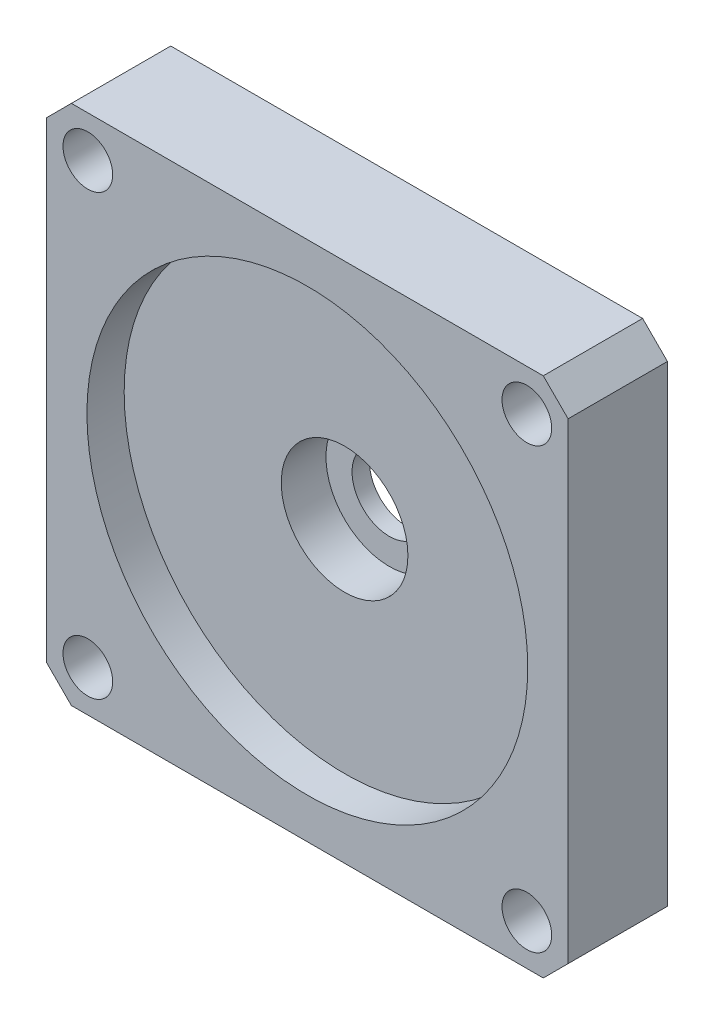
ISO-10303-21;
HEADER;
FILE_DESCRIPTION(('STEP AP214'),'2;1');
FILE_NAME('part.step','',(''),(''),'','','');
FILE_SCHEMA(('AUTOMOTIVE_DESIGN { 1 0 10303 214 1 1 1 1 }'));
ENDSEC;
DATA;
#1=APPLICATION_CONTEXT('core data for automotive mechanical design processes');
#2=APPLICATION_PROTOCOL_DEFINITION('international standard','automotive_design',2000,#1);
#3=PRODUCT_CONTEXT('',#1,'mechanical');
#4=PRODUCT('Part','Part','',(#3));
#5=PRODUCT_RELATED_PRODUCT_CATEGORY('part','',(#4));
#6=PRODUCT_DEFINITION_FORMATION('','',#4);
#7=PRODUCT_DEFINITION_CONTEXT('part definition',#1,'design');
#8=PRODUCT_DEFINITION('design','',#6,#7);
#9=PRODUCT_DEFINITION_SHAPE('','',#8);
#10=(LENGTH_UNIT() NAMED_UNIT(*) SI_UNIT(.MILLI.,.METRE.));
#11=(NAMED_UNIT(*) PLANE_ANGLE_UNIT() SI_UNIT($,.RADIAN.));
#12=(NAMED_UNIT(*) SI_UNIT($,.STERADIAN.) SOLID_ANGLE_UNIT());
#13=UNCERTAINTY_MEASURE_WITH_UNIT(LENGTH_MEASURE(1.E-05),#10,'distance_accuracy_value','');
#14=(GEOMETRIC_REPRESENTATION_CONTEXT(3) GLOBAL_UNCERTAINTY_ASSIGNED_CONTEXT((#13)) GLOBAL_UNIT_ASSIGNED_CONTEXT((#10,
#11,#12)) REPRESENTATION_CONTEXT('',''));
#15=CARTESIAN_POINT('',(0.,0.,0.));
#16=DIRECTION('',(0.,0.,1.));
#17=DIRECTION('',(1.,0.,0.));
#18=AXIS2_PLACEMENT_3D('',#15,#16,#17);
#19=CARTESIAN_POINT('',(21.,21.,8.));
#20=DIRECTION('',(-1.,0.,0.));
#21=DIRECTION('',(0.,0.,1.));
#22=AXIS2_PLACEMENT_3D('',#19,#20,#21);
#23=PLANE('',#22);
#24=DIRECTION('',(0.,1.,0.));
#25=VECTOR('',#24,1.);
#26=CARTESIAN_POINT('',(21.,21.,8.));
#27=LINE('',#26,#25);
#28=CARTESIAN_POINT('',(21.,-19.,8.));
#29=VERTEX_POINT('',#28);
#30=CARTESIAN_POINT('',(21.,19.,8.));
#31=VERTEX_POINT('',#30);
#32=EDGE_CURVE('E127',#29,#31,#27,.T.);
#33=ORIENTED_EDGE('',*,*,#32,.F.);
#34=DIRECTION('',(0.,0.,-1.));
#35=VECTOR('',#34,1.);
#36=CARTESIAN_POINT('',(21.,-19.,8.));
#37=LINE('',#36,#35);
#38=CARTESIAN_POINT('',(21.,-19.,0.));
#39=VERTEX_POINT('',#38);
#40=EDGE_CURVE('E112',#29,#39,#37,.T.);
#41=ORIENTED_EDGE('',*,*,#40,.T.);
#42=DIRECTION('',(0.,1.,0.));
#43=VECTOR('',#42,1.);
#44=CARTESIAN_POINT('',(21.,21.,0.));
#45=LINE('',#44,#43);
#46=CARTESIAN_POINT('',(21.,19.,0.));
#47=VERTEX_POINT('',#46);
#48=EDGE_CURVE('E124',#39,#47,#45,.T.);
#49=ORIENTED_EDGE('',*,*,#48,.T.);
#50=DIRECTION('',(0.,0.,1.));
#51=VECTOR('',#50,1.);
#52=CARTESIAN_POINT('',(21.,19.,8.));
#53=LINE('',#52,#51);
#54=EDGE_CURVE('E129',#47,#31,#53,.T.);
#55=ORIENTED_EDGE('',*,*,#54,.T.);
#56=EDGE_LOOP('',(#33,#41,#49,#55));
#57=FACE_BOUND('',#56,.T.);
#58=ADVANCED_FACE('F41',(#57),#23,.F.);
#59=CARTESIAN_POINT('',(-21.,21.,8.));
#60=DIRECTION('',(0.,-1.,0.));
#61=DIRECTION('',(0.,0.,-1.));
#62=AXIS2_PLACEMENT_3D('',#59,#60,#61);
#63=PLANE('',#62);
#64=DIRECTION('',(-1.,0.,0.));
#65=VECTOR('',#64,1.);
#66=CARTESIAN_POINT('',(-21.,21.,0.));
#67=LINE('',#66,#65);
#68=CARTESIAN_POINT('',(19.,21.,0.));
#69=VERTEX_POINT('',#68);
#70=CARTESIAN_POINT('',(-19.,21.,0.));
#71=VERTEX_POINT('',#70);
#72=EDGE_CURVE('E133',#69,#71,#67,.T.);
#73=ORIENTED_EDGE('',*,*,#72,.T.);
#74=DIRECTION('',(0.,0.,1.));
#75=VECTOR('',#74,1.);
#76=CARTESIAN_POINT('',(-19.,21.,8.));
#77=LINE('',#76,#75);
#78=CARTESIAN_POINT('',(-19.,21.,8.));
#79=VERTEX_POINT('',#78);
#80=EDGE_CURVE('E11',#71,#79,#77,.T.);
#81=ORIENTED_EDGE('',*,*,#80,.T.);
#82=DIRECTION('',(-1.,0.,0.));
#83=VECTOR('',#82,1.);
#84=CARTESIAN_POINT('',(-21.,21.,8.));
#85=LINE('',#84,#83);
#86=CARTESIAN_POINT('',(19.,21.,8.));
#87=VERTEX_POINT('',#86);
#88=EDGE_CURVE('E173',#87,#79,#85,.T.);
#89=ORIENTED_EDGE('',*,*,#88,.F.);
#90=DIRECTION('',(0.,0.,-1.));
#91=VECTOR('',#90,1.);
#92=CARTESIAN_POINT('',(19.,21.,8.));
#93=LINE('',#92,#91);
#94=EDGE_CURVE('E50',#87,#69,#93,.T.);
#95=ORIENTED_EDGE('',*,*,#94,.T.);
#96=EDGE_LOOP('',(#73,#81,#89,#95));
#97=FACE_BOUND('',#96,.T.);
#98=ADVANCED_FACE('F171',(#97),#63,.F.);
#99=CARTESIAN_POINT('',(-21.,21.,8.));
#100=DIRECTION('',(1.,0.,0.));
#101=DIRECTION('',(0.,0.,-1.));
#102=AXIS2_PLACEMENT_3D('',#99,#100,#101);
#103=PLANE('',#102);
#104=DIRECTION('',(0.,-1.,0.));
#105=VECTOR('',#104,1.);
#106=CARTESIAN_POINT('',(-21.,21.,0.));
#107=LINE('',#106,#105);
#108=CARTESIAN_POINT('',(-21.,19.,0.));
#109=VERTEX_POINT('',#108);
#110=CARTESIAN_POINT('',(-21.,-19.,0.));
#111=VERTEX_POINT('',#110);
#112=EDGE_CURVE('E137',#109,#111,#107,.T.);
#113=ORIENTED_EDGE('',*,*,#112,.T.);
#114=DIRECTION('',(0.,0.,1.));
#115=VECTOR('',#114,1.);
#116=CARTESIAN_POINT('',(-21.,-19.,8.));
#117=LINE('',#116,#115);
#118=CARTESIAN_POINT('',(-21.,-19.,8.));
#119=VERTEX_POINT('',#118);
#120=EDGE_CURVE('E57',#111,#119,#117,.T.);
#121=ORIENTED_EDGE('',*,*,#120,.T.);
#122=DIRECTION('',(0.,-1.,0.));
#123=VECTOR('',#122,1.);
#124=CARTESIAN_POINT('',(-21.,21.,8.));
#125=LINE('',#124,#123);
#126=CARTESIAN_POINT('',(-21.,19.,8.));
#127=VERTEX_POINT('',#126);
#128=EDGE_CURVE('E181',#127,#119,#125,.T.);
#129=ORIENTED_EDGE('',*,*,#128,.F.);
#130=DIRECTION('',(0.,0.,-1.));
#131=VECTOR('',#130,1.);
#132=CARTESIAN_POINT('',(-21.,19.,8.));
#133=LINE('',#132,#131);
#134=EDGE_CURVE('E164',#127,#109,#133,.T.);
#135=ORIENTED_EDGE('',*,*,#134,.T.);
#136=EDGE_LOOP('',(#113,#121,#129,#135));
#137=FACE_BOUND('',#136,.T.);
#138=ADVANCED_FACE('F180',(#137),#103,.F.);
#139=CARTESIAN_POINT('',(-21.,-21.,8.));
#140=DIRECTION('',(0.,1.,0.));
#141=DIRECTION('',(0.,0.,1.));
#142=AXIS2_PLACEMENT_3D('',#139,#140,#141);
#143=PLANE('',#142);
#144=DIRECTION('',(1.,0.,0.));
#145=VECTOR('',#144,1.);
#146=CARTESIAN_POINT('',(-21.,-21.,0.));
#147=LINE('',#146,#145);
#148=CARTESIAN_POINT('',(-19.,-21.,0.));
#149=VERTEX_POINT('',#148);
#150=CARTESIAN_POINT('',(19.,-21.,0.));
#151=VERTEX_POINT('',#150);
#152=EDGE_CURVE('E147',#149,#151,#147,.T.);
#153=ORIENTED_EDGE('',*,*,#152,.T.);
#154=DIRECTION('',(0.,0.,1.));
#155=VECTOR('',#154,1.);
#156=CARTESIAN_POINT('',(19.,-21.,8.));
#157=LINE('',#156,#155);
#158=CARTESIAN_POINT('',(19.,-21.,8.));
#159=VERTEX_POINT('',#158);
#160=EDGE_CURVE('E113',#151,#159,#157,.T.);
#161=ORIENTED_EDGE('',*,*,#160,.T.);
#162=DIRECTION('',(1.,0.,0.));
#163=VECTOR('',#162,1.);
#164=CARTESIAN_POINT('',(-21.,-21.,8.));
#165=LINE('',#164,#163);
#166=CARTESIAN_POINT('',(-19.,-21.,8.));
#167=VERTEX_POINT('',#166);
#168=EDGE_CURVE('E143',#167,#159,#165,.T.);
#169=ORIENTED_EDGE('',*,*,#168,.F.);
#170=DIRECTION('',(0.,0.,-1.));
#171=VECTOR('',#170,1.);
#172=CARTESIAN_POINT('',(-19.,-21.,8.));
#173=LINE('',#172,#171);
#174=EDGE_CURVE('E118',#167,#149,#173,.T.);
#175=ORIENTED_EDGE('',*,*,#174,.T.);
#176=EDGE_LOOP('',(#153,#161,#169,#175));
#177=FACE_BOUND('',#176,.T.);
#178=ADVANCED_FACE('F257',(#177),#143,.F.);
#179=CARTESIAN_POINT('',(0.,0.,8.));
#180=DIRECTION('',(0.,0.,1.));
#181=DIRECTION('',(1.,0.,0.));
#182=AXIS2_PLACEMENT_3D('',#179,#180,#181);
#183=PLANE('',#182);
#184=CARTESIAN_POINT('',(0.,0.,8.));
#185=DIRECTION('',(0.,0.,1.));
#186=DIRECTION('',(1.,0.,0.));
#187=AXIS2_PLACEMENT_3D('',#184,#185,#186);
#188=CIRCLE('',#187,17.75);
#189=CARTESIAN_POINT('',(17.75,0.,8.));
#190=VERTEX_POINT('',#189);
#191=EDGE_CURVE('E208',#190,#190,#188,.T.);
#192=ORIENTED_EDGE('',*,*,#191,.F.);
#193=EDGE_LOOP('',(#192));
#194=FACE_BOUND('',#193,.T.);
#195=CARTESIAN_POINT('',(-17.6776695296637,-17.6776695296637,8.));
#196=DIRECTION('',(0.,0.,1.));
#197=DIRECTION('',(1.,0.,0.));
#198=AXIS2_PLACEMENT_3D('',#195,#196,#197);
#199=CIRCLE('',#198,2.);
#200=CARTESIAN_POINT('',(-15.6776695296637,-17.6776695296637,8.));
#201=VERTEX_POINT('',#200);
#202=EDGE_CURVE('E190',#201,#201,#199,.T.);
#203=ORIENTED_EDGE('',*,*,#202,.F.);
#204=EDGE_LOOP('',(#203));
#205=FACE_BOUND('',#204,.T.);
#206=CARTESIAN_POINT('',(17.6776695296637,-17.6776695296637,8.));
#207=DIRECTION('',(0.,0.,1.));
#208=DIRECTION('',(1.,0.,0.));
#209=AXIS2_PLACEMENT_3D('',#206,#207,#208);
#210=CIRCLE('',#209,2.);
#211=CARTESIAN_POINT('',(19.6776695296637,-17.6776695296637,8.));
#212=VERTEX_POINT('',#211);
#213=EDGE_CURVE('E198',#212,#212,#210,.T.);
#214=ORIENTED_EDGE('',*,*,#213,.F.);
#215=EDGE_LOOP('',(#214));
#216=FACE_BOUND('',#215,.T.);
#217=CARTESIAN_POINT('',(17.6776695296637,17.6776695296637,8.));
#218=DIRECTION('',(0.,0.,1.));
#219=DIRECTION('',(1.,0.,0.));
#220=AXIS2_PLACEMENT_3D('',#217,#218,#219);
#221=CIRCLE('',#220,2.);
#222=CARTESIAN_POINT('',(19.6776695296637,17.6776695296637,8.));
#223=VERTEX_POINT('',#222);
#224=EDGE_CURVE('E189',#223,#223,#221,.T.);
#225=ORIENTED_EDGE('',*,*,#224,.F.);
#226=EDGE_LOOP('',(#225));
#227=FACE_BOUND('',#226,.T.);
#228=CARTESIAN_POINT('',(-17.6776695296637,17.6776695296637,8.));
#229=DIRECTION('',(0.,0.,1.));
#230=DIRECTION('',(1.,0.,0.));
#231=AXIS2_PLACEMENT_3D('',#228,#229,#230);
#232=CIRCLE('',#231,2.);
#233=CARTESIAN_POINT('',(-15.6776695296637,17.6776695296637,8.));
#234=VERTEX_POINT('',#233);
#235=EDGE_CURVE('E140',#234,#234,#232,.T.);
#236=ORIENTED_EDGE('',*,*,#235,.F.);
#237=EDGE_LOOP('',(#236));
#238=FACE_BOUND('',#237,.T.);
#239=ORIENTED_EDGE('',*,*,#168,.T.);
#240=DIRECTION('',(-0.707106781186549,-0.707106781186546,0.));
#241=VECTOR('',#240,1.);
#242=CARTESIAN_POINT('',(20.,-20.,8.));
#243=LINE('',#242,#241);
#244=EDGE_CURVE('E162',#159,#29,#243,.F.);
#245=ORIENTED_EDGE('',*,*,#244,.T.);
#246=ORIENTED_EDGE('',*,*,#32,.T.);
#247=DIRECTION('',(0.707106781186546,-0.707106781186549,0.));
#248=VECTOR('',#247,1.);
#249=CARTESIAN_POINT('',(20.,20.,8.));
#250=LINE('',#249,#248);
#251=EDGE_CURVE('E157',#31,#87,#250,.F.);
#252=ORIENTED_EDGE('',*,*,#251,.T.);
#253=ORIENTED_EDGE('',*,*,#88,.T.);
#254=DIRECTION('',(0.707106781186549,0.707106781186546,0.));
#255=VECTOR('',#254,1.);
#256=CARTESIAN_POINT('',(-20.,20.,8.));
#257=LINE('',#256,#255);
#258=EDGE_CURVE('E64',#79,#127,#257,.F.);
#259=ORIENTED_EDGE('',*,*,#258,.T.);
#260=ORIENTED_EDGE('',*,*,#128,.T.);
#261=DIRECTION('',(-0.707106781186546,0.707106781186549,0.));
#262=VECTOR('',#261,1.);
#263=CARTESIAN_POINT('',(-20.,-20.,8.));
#264=LINE('',#263,#262);
#265=EDGE_CURVE('E160',#119,#167,#264,.F.);
#266=ORIENTED_EDGE('',*,*,#265,.T.);
#267=EDGE_LOOP('',(#239,#245,#246,#252,#253,#259,#260,#266));
#268=FACE_BOUND('',#267,.T.);
#269=ADVANCED_FACE('F254',(#194,#205,#216,#227,#238,#268),#183,.T.);
#270=CARTESIAN_POINT('',(0.,0.,0.));
#271=DIRECTION('',(0.,0.,1.));
#272=DIRECTION('',(1.,0.,0.));
#273=AXIS2_PLACEMENT_3D('',#270,#271,#272);
#274=PLANE('',#273);
#275=CARTESIAN_POINT('',(0.,0.,0.));
#276=DIRECTION('',(0.,0.,1.));
#277=DIRECTION('',(1.,0.,0.));
#278=AXIS2_PLACEMENT_3D('',#275,#276,#277);
#279=CIRCLE('',#278,3.);
#280=CARTESIAN_POINT('',(3.,0.,0.));
#281=VERTEX_POINT('',#280);
#282=EDGE_CURVE('E217',#281,#281,#279,.F.);
#283=ORIENTED_EDGE('',*,*,#282,.F.);
#284=EDGE_LOOP('',(#283));
#285=FACE_BOUND('',#284,.T.);
#286=CARTESIAN_POINT('',(-17.6776695296637,-17.6776695296637,0.));
#287=DIRECTION('',(0.,0.,1.));
#288=DIRECTION('',(1.,0.,0.));
#289=AXIS2_PLACEMENT_3D('',#286,#287,#288);
#290=CIRCLE('',#289,2.);
#291=CARTESIAN_POINT('',(-15.6776695296637,-17.6776695296637,0.));
#292=VERTEX_POINT('',#291);
#293=EDGE_CURVE('E194',#292,#292,#290,.F.);
#294=ORIENTED_EDGE('',*,*,#293,.F.);
#295=EDGE_LOOP('',(#294));
#296=FACE_BOUND('',#295,.T.);
#297=CARTESIAN_POINT('',(17.6776695296637,-17.6776695296637,0.));
#298=DIRECTION('',(0.,0.,1.));
#299=DIRECTION('',(1.,0.,0.));
#300=AXIS2_PLACEMENT_3D('',#297,#298,#299);
#301=CIRCLE('',#300,2.);
#302=CARTESIAN_POINT('',(19.6776695296637,-17.6776695296637,0.));
#303=VERTEX_POINT('',#302);
#304=EDGE_CURVE('E193',#303,#303,#301,.F.);
#305=ORIENTED_EDGE('',*,*,#304,.F.);
#306=EDGE_LOOP('',(#305));
#307=FACE_BOUND('',#306,.T.);
#308=CARTESIAN_POINT('',(17.6776695296637,17.6776695296637,0.));
#309=DIRECTION('',(0.,0.,1.));
#310=DIRECTION('',(1.,0.,0.));
#311=AXIS2_PLACEMENT_3D('',#308,#309,#310);
#312=CIRCLE('',#311,2.);
#313=CARTESIAN_POINT('',(19.6776695296637,17.6776695296637,0.));
#314=VERTEX_POINT('',#313);
#315=EDGE_CURVE('E201',#314,#314,#312,.F.);
#316=ORIENTED_EDGE('',*,*,#315,.F.);
#317=EDGE_LOOP('',(#316));
#318=FACE_BOUND('',#317,.T.);
#319=CARTESIAN_POINT('',(-17.6776695296637,17.6776695296637,0.));
#320=DIRECTION('',(0.,0.,1.));
#321=DIRECTION('',(1.,0.,0.));
#322=AXIS2_PLACEMENT_3D('',#319,#320,#321);
#323=CIRCLE('',#322,2.);
#324=CARTESIAN_POINT('',(-15.6776695296637,17.6776695296637,0.));
#325=VERTEX_POINT('',#324);
#326=EDGE_CURVE('E134',#325,#325,#323,.F.);
#327=ORIENTED_EDGE('',*,*,#326,.F.);
#328=EDGE_LOOP('',(#327));
#329=FACE_BOUND('',#328,.T.);
#330=ORIENTED_EDGE('',*,*,#48,.F.);
#331=DIRECTION('',(0.707106781186549,0.707106781186546,0.));
#332=VECTOR('',#331,1.);
#333=CARTESIAN_POINT('',(21.,-19.,0.));
#334=LINE('',#333,#332);
#335=EDGE_CURVE('E108',#39,#151,#334,.F.);
#336=ORIENTED_EDGE('',*,*,#335,.T.);
#337=ORIENTED_EDGE('',*,*,#152,.F.);
#338=DIRECTION('',(0.707106781186546,-0.707106781186549,0.));
#339=VECTOR('',#338,1.);
#340=CARTESIAN_POINT('',(-19.,-21.,0.));
#341=LINE('',#340,#339);
#342=EDGE_CURVE('E119',#149,#111,#341,.F.);
#343=ORIENTED_EDGE('',*,*,#342,.T.);
#344=ORIENTED_EDGE('',*,*,#112,.F.);
#345=DIRECTION('',(-0.707106781186549,-0.707106781186546,0.));
#346=VECTOR('',#345,1.);
#347=CARTESIAN_POINT('',(-21.,19.,0.));
#348=LINE('',#347,#346);
#349=EDGE_CURVE('E151',#109,#71,#348,.F.);
#350=ORIENTED_EDGE('',*,*,#349,.T.);
#351=ORIENTED_EDGE('',*,*,#72,.F.);
#352=DIRECTION('',(-0.707106781186546,0.707106781186549,0.));
#353=VECTOR('',#352,1.);
#354=CARTESIAN_POINT('',(19.,21.,0.));
#355=LINE('',#354,#353);
#356=EDGE_CURVE('E128',#69,#47,#355,.F.);
#357=ORIENTED_EDGE('',*,*,#356,.T.);
#358=EDGE_LOOP('',(#330,#336,#337,#343,#344,#350,#351,#357));
#359=FACE_BOUND('',#358,.T.);
#360=ADVANCED_FACE('F131',(#285,#296,#307,#318,#329,#359),#274,.F.);
#361=CARTESIAN_POINT('',(-17.6776695296637,17.6776695296637,-0.000999999999999265));
#362=DIRECTION('',(0.,0.,1.));
#363=DIRECTION('',(1.,0.,0.));
#364=AXIS2_PLACEMENT_3D('',#361,#362,#363);
#365=CYLINDRICAL_SURFACE('',#364,2.);
#366=ORIENTED_EDGE('',*,*,#235,.T.);
#367=EDGE_LOOP('',(#366));
#368=FACE_BOUND('',#367,.T.);
#369=ORIENTED_EDGE('',*,*,#326,.T.);
#370=EDGE_LOOP('',(#369));
#371=FACE_BOUND('',#370,.T.);
#372=ADVANCED_FACE('F301',(#368,#371),#365,.F.);
#373=CARTESIAN_POINT('',(17.6776695296637,17.6776695296637,-0.000999999999999265));
#374=DIRECTION('',(0.,0.,1.));
#375=DIRECTION('',(1.,0.,0.));
#376=AXIS2_PLACEMENT_3D('',#373,#374,#375);
#377=CYLINDRICAL_SURFACE('',#376,2.);
#378=ORIENTED_EDGE('',*,*,#224,.T.);
#379=EDGE_LOOP('',(#378));
#380=FACE_BOUND('',#379,.T.);
#381=ORIENTED_EDGE('',*,*,#315,.T.);
#382=EDGE_LOOP('',(#381));
#383=FACE_BOUND('',#382,.T.);
#384=ADVANCED_FACE('F306',(#380,#383),#377,.F.);
#385=CARTESIAN_POINT('',(17.6776695296637,-17.6776695296637,-0.000999999999999265));
#386=DIRECTION('',(0.,0.,1.));
#387=DIRECTION('',(1.,0.,0.));
#388=AXIS2_PLACEMENT_3D('',#385,#386,#387);
#389=CYLINDRICAL_SURFACE('',#388,2.);
#390=ORIENTED_EDGE('',*,*,#213,.T.);
#391=EDGE_LOOP('',(#390));
#392=FACE_BOUND('',#391,.T.);
#393=ORIENTED_EDGE('',*,*,#304,.T.);
#394=EDGE_LOOP('',(#393));
#395=FACE_BOUND('',#394,.T.);
#396=ADVANCED_FACE('F310',(#392,#395),#389,.F.);
#397=CARTESIAN_POINT('',(-17.6776695296637,-17.6776695296637,-0.000999999999999265));
#398=DIRECTION('',(0.,0.,1.));
#399=DIRECTION('',(1.,0.,0.));
#400=AXIS2_PLACEMENT_3D('',#397,#398,#399);
#401=CYLINDRICAL_SURFACE('',#400,2.);
#402=ORIENTED_EDGE('',*,*,#202,.T.);
#403=EDGE_LOOP('',(#402));
#404=FACE_BOUND('',#403,.T.);
#405=ORIENTED_EDGE('',*,*,#293,.T.);
#406=EDGE_LOOP('',(#405));
#407=FACE_BOUND('',#406,.T.);
#408=ADVANCED_FACE('F250',(#404,#407),#401,.F.);
#409=CARTESIAN_POINT('',(0.,0.,5.));
#410=DIRECTION('',(0.,0.,1.));
#411=DIRECTION('',(1.,0.,0.));
#412=AXIS2_PLACEMENT_3D('',#409,#410,#411);
#413=CYLINDRICAL_SURFACE('',#412,17.75);
#414=CARTESIAN_POINT('',(0.,0.,5.));
#415=DIRECTION('',(0.,0.,1.));
#416=DIRECTION('',(1.,0.,0.));
#417=AXIS2_PLACEMENT_3D('',#414,#415,#416);
#418=CIRCLE('',#417,17.75);
#419=CARTESIAN_POINT('',(17.75,0.,5.));
#420=VERTEX_POINT('',#419);
#421=EDGE_CURVE('E197',#420,#420,#418,.T.);
#422=ORIENTED_EDGE('',*,*,#421,.F.);
#423=EDGE_LOOP('',(#422));
#424=FACE_BOUND('',#423,.T.);
#425=ORIENTED_EDGE('',*,*,#191,.T.);
#426=EDGE_LOOP('',(#425));
#427=FACE_BOUND('',#426,.T.);
#428=ADVANCED_FACE('F244',(#424,#427),#413,.F.);
#429=CARTESIAN_POINT('',(0.,0.,5.));
#430=DIRECTION('',(0.,0.,1.));
#431=DIRECTION('',(1.,0.,0.));
#432=AXIS2_PLACEMENT_3D('',#429,#430,#431);
#433=PLANE('',#432);
#434=CARTESIAN_POINT('',(0.,0.,5.));
#435=DIRECTION('',(0.,0.,1.));
#436=DIRECTION('',(1.,0.,0.));
#437=AXIS2_PLACEMENT_3D('',#434,#435,#436);
#438=CIRCLE('',#437,5.1);
#439=CARTESIAN_POINT('',(5.1,0.,5.));
#440=VERTEX_POINT('',#439);
#441=EDGE_CURVE('E214',#440,#440,#438,.T.);
#442=ORIENTED_EDGE('',*,*,#441,.F.);
#443=EDGE_LOOP('',(#442));
#444=FACE_BOUND('',#443,.T.);
#445=ORIENTED_EDGE('',*,*,#421,.T.);
#446=EDGE_LOOP('',(#445));
#447=FACE_BOUND('',#446,.T.);
#448=ADVANCED_FACE('F238',(#444,#447),#433,.T.);
#449=CARTESIAN_POINT('',(0.,0.,1.4));
#450=DIRECTION('',(0.,0.,1.));
#451=DIRECTION('',(1.,0.,0.));
#452=AXIS2_PLACEMENT_3D('',#449,#450,#451);
#453=CYLINDRICAL_SURFACE('',#452,5.1);
#454=CARTESIAN_POINT('',(0.,0.,1.4));
#455=DIRECTION('',(0.,0.,1.));
#456=DIRECTION('',(1.,0.,0.));
#457=AXIS2_PLACEMENT_3D('',#454,#455,#456);
#458=CIRCLE('',#457,5.1);
#459=CARTESIAN_POINT('',(5.1,0.,1.4));
#460=VERTEX_POINT('',#459);
#461=EDGE_CURVE('E211',#460,#460,#458,.T.);
#462=ORIENTED_EDGE('',*,*,#461,.F.);
#463=EDGE_LOOP('',(#462));
#464=FACE_BOUND('',#463,.T.);
#465=ORIENTED_EDGE('',*,*,#441,.T.);
#466=EDGE_LOOP('',(#465));
#467=FACE_BOUND('',#466,.T.);
#468=ADVANCED_FACE('F232',(#464,#467),#453,.F.);
#469=CARTESIAN_POINT('',(0.,0.,1.4));
#470=DIRECTION('',(0.,0.,1.));
#471=DIRECTION('',(1.,0.,0.));
#472=AXIS2_PLACEMENT_3D('',#469,#470,#471);
#473=PLANE('',#472);
#474=CARTESIAN_POINT('',(0.,0.,1.4));
#475=DIRECTION('',(0.,0.,1.));
#476=DIRECTION('',(1.,0.,0.));
#477=AXIS2_PLACEMENT_3D('',#474,#475,#476);
#478=CIRCLE('',#477,3.);
#479=CARTESIAN_POINT('',(3.,0.,1.4));
#480=VERTEX_POINT('',#479);
#481=EDGE_CURVE('E222',#480,#480,#478,.T.);
#482=ORIENTED_EDGE('',*,*,#481,.F.);
#483=EDGE_LOOP('',(#482));
#484=FACE_BOUND('',#483,.T.);
#485=ORIENTED_EDGE('',*,*,#461,.T.);
#486=EDGE_LOOP('',(#485));
#487=FACE_BOUND('',#486,.T.);
#488=ADVANCED_FACE('F229',(#484,#487),#473,.T.);
#489=CARTESIAN_POINT('',(0.,0.,-0.000999999999999916));
#490=DIRECTION('',(0.,0.,1.));
#491=DIRECTION('',(1.,0.,0.));
#492=AXIS2_PLACEMENT_3D('',#489,#490,#491);
#493=CYLINDRICAL_SURFACE('',#492,3.);
#494=ORIENTED_EDGE('',*,*,#481,.T.);
#495=EDGE_LOOP('',(#494));
#496=FACE_BOUND('',#495,.T.);
#497=ORIENTED_EDGE('',*,*,#282,.T.);
#498=EDGE_LOOP('',(#497));
#499=FACE_BOUND('',#498,.T.);
#500=ADVANCED_FACE('F226',(#496,#499),#493,.F.);
#501=CARTESIAN_POINT('',(21.,-19.,8.));
#502=DIRECTION('',(-0.707106781186546,0.707106781186549,0.));
#503=DIRECTION('',(0.,0.,-1.));
#504=AXIS2_PLACEMENT_3D('',#501,#502,#503);
#505=PLANE('',#504);
#506=ORIENTED_EDGE('',*,*,#244,.F.);
#507=ORIENTED_EDGE('',*,*,#160,.F.);
#508=ORIENTED_EDGE('',*,*,#335,.F.);
#509=ORIENTED_EDGE('',*,*,#40,.F.);
#510=EDGE_LOOP('',(#506,#507,#508,#509));
#511=FACE_BOUND('',#510,.T.);
#512=ADVANCED_FACE('F111',(#511),#505,.F.);
#513=CARTESIAN_POINT('',(-19.,-21.,8.));
#514=DIRECTION('',(0.707106781186549,0.707106781186546,0.));
#515=DIRECTION('',(0.,0.,-1.));
#516=AXIS2_PLACEMENT_3D('',#513,#514,#515);
#517=PLANE('',#516);
#518=ORIENTED_EDGE('',*,*,#265,.F.);
#519=ORIENTED_EDGE('',*,*,#120,.F.);
#520=ORIENTED_EDGE('',*,*,#342,.F.);
#521=ORIENTED_EDGE('',*,*,#174,.F.);
#522=EDGE_LOOP('',(#518,#519,#520,#521));
#523=FACE_BOUND('',#522,.T.);
#524=ADVANCED_FACE('F270',(#523),#517,.F.);
#525=CARTESIAN_POINT('',(-21.,19.,8.));
#526=DIRECTION('',(0.707106781186546,-0.707106781186549,0.));
#527=DIRECTION('',(0.,0.,-1.));
#528=AXIS2_PLACEMENT_3D('',#525,#526,#527);
#529=PLANE('',#528);
#530=ORIENTED_EDGE('',*,*,#258,.F.);
#531=ORIENTED_EDGE('',*,*,#80,.F.);
#532=ORIENTED_EDGE('',*,*,#349,.F.);
#533=ORIENTED_EDGE('',*,*,#134,.F.);
#534=EDGE_LOOP('',(#530,#531,#532,#533));
#535=FACE_BOUND('',#534,.T.);
#536=ADVANCED_FACE('F179',(#535),#529,.F.);
#537=CARTESIAN_POINT('',(19.,21.,8.));
#538=DIRECTION('',(-0.707106781186549,-0.707106781186546,0.));
#539=DIRECTION('',(0.,0.,-1.));
#540=AXIS2_PLACEMENT_3D('',#537,#538,#539);
#541=PLANE('',#540);
#542=ORIENTED_EDGE('',*,*,#251,.F.);
#543=ORIENTED_EDGE('',*,*,#54,.F.);
#544=ORIENTED_EDGE('',*,*,#356,.F.);
#545=ORIENTED_EDGE('',*,*,#94,.F.);
#546=EDGE_LOOP('',(#542,#543,#544,#545));
#547=FACE_BOUND('',#546,.T.);
#548=ADVANCED_FACE('F44',(#547),#541,.F.);
#549=CLOSED_SHELL('',(#58,#98,#138,#178,#269,#360,#372,#384,#396,#408,#428,#448,#468,#488,#500,
#512,#524,#536,#548));
#550=MANIFOLD_SOLID_BREP('B2',#549);
#551=ADVANCED_BREP_SHAPE_REPRESENTATION('',(#18,#550),#14);
#552=SHAPE_DEFINITION_REPRESENTATION(#9,#551);
ENDSEC;
END-ISO-10303-21;
